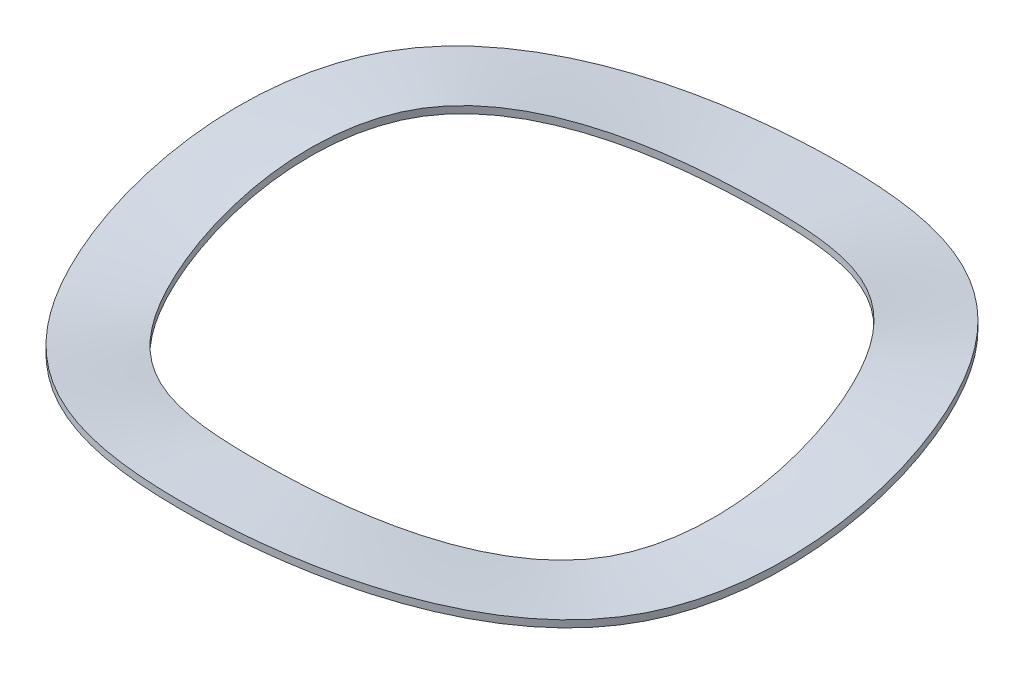
ISO-10303-21;
HEADER;
FILE_DESCRIPTION(('STEP AP214'),'2;1');
FILE_NAME('part.step','',(''),(''),'','','');
FILE_SCHEMA(('AUTOMOTIVE_DESIGN { 1 0 10303 214 1 1 1 1 }'));
ENDSEC;
DATA;
#1=APPLICATION_CONTEXT('core data for automotive mechanical design processes');
#2=APPLICATION_PROTOCOL_DEFINITION('international standard','automotive_design',2000,#1);
#3=PRODUCT_CONTEXT('',#1,'mechanical');
#4=PRODUCT('Part','Part','',(#3));
#5=PRODUCT_RELATED_PRODUCT_CATEGORY('part','',(#4));
#6=PRODUCT_DEFINITION_FORMATION('','',#4);
#7=PRODUCT_DEFINITION_CONTEXT('part definition',#1,'design');
#8=PRODUCT_DEFINITION('design','',#6,#7);
#9=PRODUCT_DEFINITION_SHAPE('','',#8);
#10=(LENGTH_UNIT() NAMED_UNIT(*) SI_UNIT(.MILLI.,.METRE.));
#11=(NAMED_UNIT(*) PLANE_ANGLE_UNIT() SI_UNIT($,.RADIAN.));
#12=(NAMED_UNIT(*) SI_UNIT($,.STERADIAN.) SOLID_ANGLE_UNIT());
#13=UNCERTAINTY_MEASURE_WITH_UNIT(LENGTH_MEASURE(1.E-05),#10,'distance_accuracy_value','');
#14=(GEOMETRIC_REPRESENTATION_CONTEXT(3) GLOBAL_UNCERTAINTY_ASSIGNED_CONTEXT((#13)) GLOBAL_UNIT_ASSIGNED_CONTEXT((#10,
#11,#12)) REPRESENTATION_CONTEXT('',''));
#15=CARTESIAN_POINT('',(0.,0.,0.));
#16=DIRECTION('',(0.,0.,1.));
#17=DIRECTION('',(1.,0.,0.));
#18=AXIS2_PLACEMENT_3D('',#15,#16,#17);
#19=CARTESIAN_POINT('',(-6.21724893790088E-12,0.,-10.6553000000025));
#20=CARTESIAN_POINT('',(3.69110419397156,0.,-10.6553000000078));
#21=CARTESIAN_POINT('',(11.0733125819271,3.12420000000024,-6.39318000000788));
#22=CARTESIAN_POINT('',(11.0733125819298,-1.56210000000012,6.39317999999367));
#23=CARTESIAN_POINT('',(-4.44089209850063E-12,3.1241999999998,12.7863599999971));
#24=CARTESIAN_POINT('',(-11.0733125819387,-1.56209999999835,6.39317999999367));
#25=CARTESIAN_POINT('',(-11.0733125819431,1.5621000000019,-2.13106000000529));
#26=CARTESIAN_POINT('',(-7.38220838795911,1.56210000000012,-8.52424000000607));
#27=CARTESIAN_POINT('',(-3.69110419398311,0.,-10.6553000000025));
#28=CARTESIAN_POINT('',(-6.21724893790088E-12,0.,-10.6553000000025));
#29=CARTESIAN_POINT('',(-3.5527136788005E-12,0.,-11.6755333333414));
#30=CARTESIAN_POINT('',(4.04452338775485,0.,-11.6755333333378));
#31=CARTESIAN_POINT('',(12.1335701632734,3.12420000000024,-7.00532000000731));
#32=CARTESIAN_POINT('',(12.1335701632734,-1.56210000000012,7.00531999999221));
#33=CARTESIAN_POINT('',(-2.66453525910038E-12,3.1241999999998,14.0106399999924));
#34=CARTESIAN_POINT('',(-12.133570163285,-1.56209999999835,7.0053199999931));
#35=CARTESIAN_POINT('',(-12.1335701632841,1.5621000000019,-2.33510666667502));
#36=CARTESIAN_POINT('',(-8.08904677552302,1.5621000000019,-9.34042666667256));
#37=CARTESIAN_POINT('',(-4.04452338776462,0.,-11.6755333333369));
#38=CARTESIAN_POINT('',(-3.5527136788005E-12,0.,-11.6755333333414));
#39=CARTESIAN_POINT('',(-6.21724893790088E-12,0.,-12.6957666666732));
#40=CARTESIAN_POINT('',(4.39794258153814,0.,-12.6957666666705));
#41=CARTESIAN_POINT('',(13.1938277446215,3.12420000000024,-7.61746000000407));
#42=CARTESIAN_POINT('',(13.1938277446162,-1.56210000000012,7.6174599999943));
#43=CARTESIAN_POINT('',(-6.21724893790088E-12,3.1241999999998,15.2349199999948));
#44=CARTESIAN_POINT('',(-13.1938277446286,-1.56209999999835,7.61745999999341));
#45=CARTESIAN_POINT('',(-13.1938277446304,1.5621000000019,-2.53915333333676));
#46=CARTESIAN_POINT('',(-8.79588516308605,1.5621000000019,-10.1566133333408));
#47=CARTESIAN_POINT('',(-4.39794258155057,0.,-12.6957666666723));
#48=CARTESIAN_POINT('',(-6.21724893790088E-12,0.,-12.6957666666732));
#49=CARTESIAN_POINT('',(-9.76996261670138E-12,0.,-13.7160000000041));
#50=CARTESIAN_POINT('',(4.75136177531965,0.,-13.7160000000076));
#51=CARTESIAN_POINT('',(14.2540853259616,3.12420000000024,-8.22960000000705));
#52=CARTESIAN_POINT('',(14.2540853259634,-1.56210000000012,8.22959999999551));
#53=CARTESIAN_POINT('',(-5.32907051820075E-12,3.1241999999998,16.4591999999963));
#54=CARTESIAN_POINT('',(-14.2540853259732,-1.56209999999835,8.22959999999551));
#55=CARTESIAN_POINT('',(-14.2540853259758,1.5621000000019,-2.74320000000738));
#56=CARTESIAN_POINT('',(-9.50272355064907,1.5621000000019,-10.9728000000091));
#57=CARTESIAN_POINT('',(-4.75136177532853,0.,-13.7160000000041));
#58=CARTESIAN_POINT('',(-9.76996261670138E-12,0.,-13.7160000000041));
#59=B_SPLINE_SURFACE_WITH_KNOTS('',3,3,((#19,#20,#21,#22,#23,#24,#25,#26,#27,#28),(#29,#30,#31,
#32,#33,#34,#35,#36,#37,#38),(#39,#40,#41,#42,#43,#44,#45,#46,#47,#48),(#49,#50,#51,#52,#53,#54,
#55,#56,#57,#58)),.UNSPECIFIED.,.F.,.T.,.F.,(4,4),(4,1,1,1,1,2,4),(0.,1.),(0.,0.166666666666667,
0.333333333333334,0.5,0.666666666666666,0.833333333333333,1.),.UNSPECIFIED.);
#60=CARTESIAN_POINT('',(-6.21724893790088E-12,0.,-10.6553000000025));
#61=CARTESIAN_POINT('',(3.69110419397156,0.,-10.6553000000078));
#62=CARTESIAN_POINT('',(11.0733125819271,3.12420000000024,-6.39318000000788));
#63=CARTESIAN_POINT('',(11.0733125819298,-1.56210000000012,6.39317999999367));
#64=CARTESIAN_POINT('',(-4.44089209850063E-12,3.1241999999998,12.7863599999971));
#65=CARTESIAN_POINT('',(-11.0733125819387,-1.56209999999835,6.39317999999367));
#66=CARTESIAN_POINT('',(-11.0733125819431,1.5621000000019,-2.13106000000529));
#67=CARTESIAN_POINT('',(-7.38220838795911,1.56210000000012,-8.52424000000607));
#68=CARTESIAN_POINT('',(-3.69110419398311,0.,-10.6553000000025));
#69=CARTESIAN_POINT('',(-6.21724893790088E-12,0.,-10.6553000000025));
#70=B_SPLINE_CURVE_WITH_KNOTS('',3,(#60,#61,#62,#63,#64,#65,#66,#67,#68,#69),.UNSPECIFIED.,.T.,
.F.,(4,1,1,1,1,2,4),(0.,0.166666666666667,0.333333333333334,0.5,0.666666666666666,
0.833333333333333,1.),.UNSPECIFIED.);
#71=CARTESIAN_POINT('',(-6.21724893790088E-12,0.,-10.6553000000025));
#72=VERTEX_POINT('',#71);
#73=EDGE_CURVE('E31',#72,#72,#70,.T.);
#74=CARTESIAN_POINT('',(-9.76996261670138E-12,0.,-13.7160000000041));
#75=CARTESIAN_POINT('',(4.75136177531965,0.,-13.7160000000076));
#76=CARTESIAN_POINT('',(14.2540853259616,3.12420000000024,-8.22960000000705));
#77=CARTESIAN_POINT('',(14.2540853259634,-1.56210000000012,8.22959999999551));
#78=CARTESIAN_POINT('',(-5.32907051820075E-12,3.1241999999998,16.4591999999963));
#79=CARTESIAN_POINT('',(-14.2540853259732,-1.56209999999835,8.22959999999551));
#80=CARTESIAN_POINT('',(-14.2540853259758,1.5621000000019,-2.74320000000738));
#81=CARTESIAN_POINT('',(-9.50272355064907,1.5621000000019,-10.9728000000091));
#82=CARTESIAN_POINT('',(-4.75136177532853,0.,-13.7160000000041));
#83=CARTESIAN_POINT('',(-9.76996261670138E-12,0.,-13.7160000000041));
#84=B_SPLINE_CURVE_WITH_KNOTS('',3,(#74,#75,#76,#77,#78,#79,#80,#81,#82,#83),.UNSPECIFIED.,.T.,
.F.,(4,1,1,1,1,2,4),(0.,0.166666666666667,0.333333333333334,0.5,0.666666666666666,
0.833333333333333,1.),.UNSPECIFIED.);
#85=CARTESIAN_POINT('',(-9.76996261670138E-12,0.,-13.7160000000041));
#86=VERTEX_POINT('',#85);
#87=EDGE_CURVE('E20',#86,#86,#84,.F.);
#88=ORIENTED_EDGE('',*,*,#73,.F.);
#89=EDGE_LOOP('',(#88));
#90=FACE_BOUND('',#89,.T.);
#91=ORIENTED_EDGE('',*,*,#87,.F.);
#92=EDGE_LOOP('',(#91));
#93=FACE_BOUND('',#92,.T.);
#94=ADVANCED_FACE('F14',(#90,#93),#59,.T.);
#95=CARTESIAN_POINT('',(-9.76996261670138E-12,0.,-13.7160000000041));
#96=CARTESIAN_POINT('',(4.75136177531965,0.,-13.7160000000076));
#97=CARTESIAN_POINT('',(14.2540853259616,3.12420000000024,-8.22960000000705));
#98=CARTESIAN_POINT('',(14.2540853259634,-1.56210000000012,8.22959999999551));
#99=CARTESIAN_POINT('',(-5.32907051820075E-12,3.1241999999998,16.4591999999963));
#100=CARTESIAN_POINT('',(-14.2540853259732,-1.56209999999835,8.22959999999551));
#101=CARTESIAN_POINT('',(-14.2540853259758,1.5621000000019,-2.74320000000738));
#102=CARTESIAN_POINT('',(-9.50272355064907,1.5621000000019,-10.9728000000091));
#103=CARTESIAN_POINT('',(-4.75136177532853,0.,-13.7160000000041));
#104=CARTESIAN_POINT('',(-9.76996261670138E-12,0.,-13.7160000000041));
#105=CARTESIAN_POINT('',(-9.76996261670138E-12,0.0973666666665984,-13.7160000000041));
#106=CARTESIAN_POINT('',(4.75136177531965,0.0973666666665984,-13.7160000000076));
#107=CARTESIAN_POINT('',(14.2540853259616,3.22156666666684,-8.22960000000705));
#108=CARTESIAN_POINT('',(14.2540853259634,-1.46473333333308,8.22959999999551));
#109=CARTESIAN_POINT('',(-5.32907051820075E-12,3.22156666666684,16.4591999999963));
#110=CARTESIAN_POINT('',(-14.2540853259732,-1.46473333333175,8.22959999999551));
#111=CARTESIAN_POINT('',(-14.2540853259758,1.6594666666685,-2.74320000000738));
#112=CARTESIAN_POINT('',(-9.50272355064907,1.6594666666685,-10.9728000000091));
#113=CARTESIAN_POINT('',(-4.75136177532853,0.0973666666665984,-13.7160000000041));
#114=CARTESIAN_POINT('',(-9.76996261670138E-12,0.0973666666665984,-13.7160000000041));
#115=CARTESIAN_POINT('',(-9.76996261670138E-12,0.194733333333197,-13.7160000000041));
#116=CARTESIAN_POINT('',(4.75136177531965,0.194733333333197,-13.7160000000076));
#117=CARTESIAN_POINT('',(14.2540853259616,3.31893333333344,-8.22960000000705));
#118=CARTESIAN_POINT('',(14.2540853259634,-1.36736666666648,8.22959999999551));
#119=CARTESIAN_POINT('',(-5.32907051820075E-12,3.31893333333344,16.4591999999963));
#120=CARTESIAN_POINT('',(-14.2540853259732,-1.3673666666647,8.22959999999551));
#121=CARTESIAN_POINT('',(-14.2540853259758,1.75683333333509,-2.74320000000738));
#122=CARTESIAN_POINT('',(-9.50272355064907,1.75683333333509,-10.9728000000091));
#123=CARTESIAN_POINT('',(-4.75136177532853,0.194733333333197,-13.7160000000041));
#124=CARTESIAN_POINT('',(-9.76996261670138E-12,0.194733333333197,-13.7160000000041));
#125=CARTESIAN_POINT('',(-9.76996261670138E-12,0.292099999999795,-13.7160000000041));
#126=CARTESIAN_POINT('',(4.75136177531965,0.292099999999795,-13.7160000000076));
#127=CARTESIAN_POINT('',(14.2540853259616,3.41630000000004,-8.22960000000705));
#128=CARTESIAN_POINT('',(14.2540853259634,-1.26999999999988,8.22959999999551));
#129=CARTESIAN_POINT('',(-5.32907051820075E-12,3.41630000000004,16.4591999999963));
#130=CARTESIAN_POINT('',(-14.2540853259732,-1.26999999999811,8.22959999999551));
#131=CARTESIAN_POINT('',(-14.2540853259758,1.85420000000169,-2.74320000000738));
#132=CARTESIAN_POINT('',(-9.50272355064907,1.85420000000169,-10.9728000000091));
#133=CARTESIAN_POINT('',(-4.75136177532853,0.292099999999795,-13.7160000000041));
#134=CARTESIAN_POINT('',(-9.76996261670138E-12,0.292099999999795,-13.7160000000041));
#135=B_SPLINE_SURFACE_WITH_KNOTS('',3,3,((#95,#96,#97,#98,#99,#100,#101,#102,#103,#104),(#105,
#106,#107,#108,#109,#110,#111,#112,#113,#114),(#115,#116,#117,#118,#119,#120,#121,#122,#123,
#124),(#125,#126,#127,#128,#129,#130,#131,#132,#133,#134)),.UNSPECIFIED.,.F.,.T.,.F.,(4,4),(4,1,
1,1,1,2,4),(0.,1.),(0.,0.166666666666667,0.333333333333334,0.5,0.666666666666666,
0.833333333333333,1.),.UNSPECIFIED.);
#136=CARTESIAN_POINT('',(-9.76996261670138E-12,0.292099999999795,-13.7160000000041));
#137=CARTESIAN_POINT('',(4.75136177531965,0.292099999999795,-13.7160000000076));
#138=CARTESIAN_POINT('',(14.2540853259616,3.41630000000004,-8.22960000000705));
#139=CARTESIAN_POINT('',(14.2540853259634,-1.26999999999988,8.22959999999551));
#140=CARTESIAN_POINT('',(-5.32907051820075E-12,3.41630000000004,16.4591999999963));
#141=CARTESIAN_POINT('',(-14.2540853259732,-1.26999999999811,8.22959999999551));
#142=CARTESIAN_POINT('',(-14.2540853259758,1.85420000000169,-2.74320000000738));
#143=CARTESIAN_POINT('',(-9.50272355064907,1.85420000000169,-10.9728000000091));
#144=CARTESIAN_POINT('',(-4.75136177532853,0.292099999999795,-13.7160000000041));
#145=CARTESIAN_POINT('',(-9.76996261670138E-12,0.292099999999795,-13.7160000000041));
#146=B_SPLINE_CURVE_WITH_KNOTS('',3,(#136,#137,#138,#139,#140,#141,#142,#143,#144,#145),
.UNSPECIFIED.,.T.,.F.,(4,1,1,1,1,2,4),(0.,0.166666666666667,0.333333333333334,0.5,
0.666666666666666,0.833333333333333,1.),.UNSPECIFIED.);
#147=CARTESIAN_POINT('',(-9.76996261670138E-12,0.292099999999795,-13.7160000000041));
#148=VERTEX_POINT('',#147);
#149=EDGE_CURVE('E26',#148,#148,#146,.F.);
#150=ORIENTED_EDGE('',*,*,#87,.T.);
#151=EDGE_LOOP('',(#150));
#152=FACE_BOUND('',#151,.T.);
#153=ORIENTED_EDGE('',*,*,#149,.F.);
#154=EDGE_LOOP('',(#153));
#155=FACE_BOUND('',#154,.T.);
#156=ADVANCED_FACE('F54',(#152,#155),#135,.T.);
#157=CARTESIAN_POINT('',(-6.21724893790088E-12,0.292099999999795,-10.6553000000025));
#158=CARTESIAN_POINT('',(3.69110419397156,0.292099999999795,-10.6553000000078));
#159=CARTESIAN_POINT('',(11.0733125819271,3.41630000000004,-6.39318000000788));
#160=CARTESIAN_POINT('',(11.0733125819298,-1.26999999999988,6.39317999999367));
#161=CARTESIAN_POINT('',(-4.44089209850063E-12,3.41630000000004,12.7863599999971));
#162=CARTESIAN_POINT('',(-11.0733125819387,-1.26999999999811,6.39317999999367));
#163=CARTESIAN_POINT('',(-11.0733125819431,1.85420000000169,-2.13106000000529));
#164=CARTESIAN_POINT('',(-7.38220838795911,1.85419999999992,-8.52424000000607));
#165=CARTESIAN_POINT('',(-3.69110419398311,0.292099999999795,-10.6553000000025));
#166=CARTESIAN_POINT('',(-6.21724893790088E-12,0.292099999999795,-10.6553000000025));
#167=CARTESIAN_POINT('',(-6.21724893790088E-12,0.194733333333197,-10.6553000000025));
#168=CARTESIAN_POINT('',(3.69110419397156,0.194733333333197,-10.6553000000078));
#169=CARTESIAN_POINT('',(11.0733125819271,3.31893333333344,-6.39318000000788));
#170=CARTESIAN_POINT('',(11.0733125819298,-1.36736666666648,6.39317999999367));
#171=CARTESIAN_POINT('',(-4.44089209850063E-12,3.31893333333344,12.7863599999971));
#172=CARTESIAN_POINT('',(-11.0733125819387,-1.3673666666647,6.39317999999367));
#173=CARTESIAN_POINT('',(-11.0733125819431,1.75683333333509,-2.13106000000529));
#174=CARTESIAN_POINT('',(-7.38220838795911,1.75683333333332,-8.52424000000607));
#175=CARTESIAN_POINT('',(-3.69110419398311,0.194733333333197,-10.6553000000025));
#176=CARTESIAN_POINT('',(-6.21724893790088E-12,0.194733333333197,-10.6553000000025));
#177=CARTESIAN_POINT('',(-6.21724893790088E-12,0.0973666666665984,-10.6553000000025));
#178=CARTESIAN_POINT('',(3.69110419397156,0.0973666666665984,-10.6553000000078));
#179=CARTESIAN_POINT('',(11.0733125819271,3.22156666666684,-6.39318000000788));
#180=CARTESIAN_POINT('',(11.0733125819298,-1.46473333333308,6.39317999999367));
#181=CARTESIAN_POINT('',(-4.44089209850063E-12,3.22156666666684,12.7863599999971));
#182=CARTESIAN_POINT('',(-11.0733125819387,-1.46473333333175,6.39317999999367));
#183=CARTESIAN_POINT('',(-11.0733125819431,1.6594666666685,-2.13106000000529));
#184=CARTESIAN_POINT('',(-7.38220838795911,1.65946666666672,-8.52424000000607));
#185=CARTESIAN_POINT('',(-3.69110419398311,0.0973666666665984,-10.6553000000025));
#186=CARTESIAN_POINT('',(-6.21724893790088E-12,0.0973666666665984,-10.6553000000025));
#187=CARTESIAN_POINT('',(-6.21724893790088E-12,0.,-10.6553000000025));
#188=CARTESIAN_POINT('',(3.69110419397156,0.,-10.6553000000078));
#189=CARTESIAN_POINT('',(11.0733125819271,3.12420000000024,-6.39318000000788));
#190=CARTESIAN_POINT('',(11.0733125819298,-1.56210000000012,6.39317999999367));
#191=CARTESIAN_POINT('',(-4.44089209850063E-12,3.1241999999998,12.7863599999971));
#192=CARTESIAN_POINT('',(-11.0733125819387,-1.56209999999835,6.39317999999367));
#193=CARTESIAN_POINT('',(-11.0733125819431,1.5621000000019,-2.13106000000529));
#194=CARTESIAN_POINT('',(-7.38220838795911,1.56210000000012,-8.52424000000607));
#195=CARTESIAN_POINT('',(-3.69110419398311,0.,-10.6553000000025));
#196=CARTESIAN_POINT('',(-6.21724893790088E-12,0.,-10.6553000000025));
#197=B_SPLINE_SURFACE_WITH_KNOTS('',3,3,((#157,#158,#159,#160,#161,#162,#163,#164,#165,#166),
(#167,#168,#169,#170,#171,#172,#173,#174,#175,#176),(#177,#178,#179,#180,#181,#182,#183,#184,
#185,#186),(#187,#188,#189,#190,#191,#192,#193,#194,#195,#196)),.UNSPECIFIED.,.F.,.T.,.F.,(4,4),
(4,1,1,1,1,2,4),(0.,1.),(0.,0.166666666666667,0.333333333333334,0.5,0.666666666666666,
0.833333333333333,1.),.UNSPECIFIED.);
#198=CARTESIAN_POINT('',(-6.21724893790088E-12,0.292099999999795,-10.6553000000025));
#199=CARTESIAN_POINT('',(3.69110419397156,0.292099999999795,-10.6553000000078));
#200=CARTESIAN_POINT('',(11.0733125819271,3.41630000000004,-6.39318000000788));
#201=CARTESIAN_POINT('',(11.0733125819298,-1.26999999999988,6.39317999999367));
#202=CARTESIAN_POINT('',(-4.44089209850063E-12,3.41630000000004,12.7863599999971));
#203=CARTESIAN_POINT('',(-11.0733125819387,-1.26999999999811,6.39317999999367));
#204=CARTESIAN_POINT('',(-11.0733125819431,1.85420000000169,-2.13106000000529));
#205=CARTESIAN_POINT('',(-7.38220838795911,1.85419999999992,-8.52424000000607));
#206=CARTESIAN_POINT('',(-3.69110419398311,0.292099999999795,-10.6553000000025));
#207=CARTESIAN_POINT('',(-6.21724893790088E-12,0.292099999999795,-10.6553000000025));
#208=B_SPLINE_CURVE_WITH_KNOTS('',3,(#198,#199,#200,#201,#202,#203,#204,#205,#206,#207),
.UNSPECIFIED.,.T.,.F.,(4,1,1,1,1,2,4),(0.,0.166666666666667,0.333333333333334,0.5,
0.666666666666666,0.833333333333333,1.),.UNSPECIFIED.);
#209=CARTESIAN_POINT('',(-6.21724893790088E-12,0.292099999999795,-10.6553000000025));
#210=VERTEX_POINT('',#209);
#211=EDGE_CURVE('E10',#210,#210,#208,.T.);
#212=ORIENTED_EDGE('',*,*,#73,.T.);
#213=EDGE_LOOP('',(#212));
#214=FACE_BOUND('',#213,.T.);
#215=ORIENTED_EDGE('',*,*,#211,.F.);
#216=EDGE_LOOP('',(#215));
#217=FACE_BOUND('',#216,.T.);
#218=ADVANCED_FACE('F64',(#214,#217),#197,.T.);
#219=CARTESIAN_POINT('',(-9.76996261670138E-12,0.292099999999795,-13.7160000000041));
#220=CARTESIAN_POINT('',(4.75136177531965,0.292099999999795,-13.7160000000076));
#221=CARTESIAN_POINT('',(14.2540853259616,3.41630000000004,-8.22960000000705));
#222=CARTESIAN_POINT('',(14.2540853259634,-1.26999999999988,8.22959999999551));
#223=CARTESIAN_POINT('',(-5.32907051820075E-12,3.41630000000004,16.4591999999963));
#224=CARTESIAN_POINT('',(-14.2540853259732,-1.26999999999811,8.22959999999551));
#225=CARTESIAN_POINT('',(-14.2540853259758,1.85420000000169,-2.74320000000738));
#226=CARTESIAN_POINT('',(-9.50272355064907,1.85420000000169,-10.9728000000091));
#227=CARTESIAN_POINT('',(-4.75136177532853,0.292099999999795,-13.7160000000041));
#228=CARTESIAN_POINT('',(-9.76996261670138E-12,0.292099999999795,-13.7160000000041));
#229=CARTESIAN_POINT('',(-6.21724893790088E-12,0.292099999999795,-12.6957666666732));
#230=CARTESIAN_POINT('',(4.39794258153814,0.292099999999795,-12.6957666666705));
#231=CARTESIAN_POINT('',(13.1938277446215,3.41630000000004,-7.61746000000407));
#232=CARTESIAN_POINT('',(13.1938277446162,-1.26999999999988,7.6174599999943));
#233=CARTESIAN_POINT('',(-6.21724893790088E-12,3.41630000000004,15.2349199999948));
#234=CARTESIAN_POINT('',(-13.1938277446286,-1.26999999999811,7.61745999999341));
#235=CARTESIAN_POINT('',(-13.1938277446304,1.85420000000169,-2.53915333333676));
#236=CARTESIAN_POINT('',(-8.79588516308605,1.85420000000169,-10.1566133333408));
#237=CARTESIAN_POINT('',(-4.39794258155057,0.292099999999795,-12.6957666666723));
#238=CARTESIAN_POINT('',(-6.21724893790088E-12,0.292099999999795,-12.6957666666732));
#239=CARTESIAN_POINT('',(-3.5527136788005E-12,0.292099999999795,-11.6755333333414));
#240=CARTESIAN_POINT('',(4.04452338775485,0.292099999999795,-11.6755333333378));
#241=CARTESIAN_POINT('',(12.1335701632734,3.41630000000004,-7.00532000000731));
#242=CARTESIAN_POINT('',(12.1335701632734,-1.26999999999988,7.00531999999221));
#243=CARTESIAN_POINT('',(-2.66453525910038E-12,3.41630000000004,14.0106399999924));
#244=CARTESIAN_POINT('',(-12.133570163285,-1.26999999999811,7.0053199999931));
#245=CARTESIAN_POINT('',(-12.1335701632841,1.85420000000169,-2.33510666667502));
#246=CARTESIAN_POINT('',(-8.08904677552302,1.85420000000169,-9.34042666667256));
#247=CARTESIAN_POINT('',(-4.04452338776462,0.292099999999795,-11.6755333333369));
#248=CARTESIAN_POINT('',(-3.5527136788005E-12,0.292099999999795,-11.6755333333414));
#249=CARTESIAN_POINT('',(-6.21724893790088E-12,0.292099999999795,-10.6553000000025));
#250=CARTESIAN_POINT('',(3.69110419397156,0.292099999999795,-10.6553000000078));
#251=CARTESIAN_POINT('',(11.0733125819271,3.41630000000004,-6.39318000000788));
#252=CARTESIAN_POINT('',(11.0733125819298,-1.26999999999988,6.39317999999367));
#253=CARTESIAN_POINT('',(-4.44089209850063E-12,3.41630000000004,12.7863599999971));
#254=CARTESIAN_POINT('',(-11.0733125819387,-1.26999999999811,6.39317999999367));
#255=CARTESIAN_POINT('',(-11.0733125819431,1.85420000000169,-2.13106000000529));
#256=CARTESIAN_POINT('',(-7.38220838795911,1.85419999999992,-8.52424000000607));
#257=CARTESIAN_POINT('',(-3.69110419398311,0.292099999999795,-10.6553000000025));
#258=CARTESIAN_POINT('',(-6.21724893790088E-12,0.292099999999795,-10.6553000000025));
#259=B_SPLINE_SURFACE_WITH_KNOTS('',3,3,((#219,#220,#221,#222,#223,#224,#225,#226,#227,#228),
(#229,#230,#231,#232,#233,#234,#235,#236,#237,#238),(#239,#240,#241,#242,#243,#244,#245,#246,
#247,#248),(#249,#250,#251,#252,#253,#254,#255,#256,#257,#258)),.UNSPECIFIED.,.F.,.T.,.F.,(4,4),
(4,1,1,1,1,2,4),(0.,1.),(0.,0.166666666666667,0.333333333333334,0.5,0.666666666666666,
0.833333333333333,1.),.UNSPECIFIED.);
#260=ORIENTED_EDGE('',*,*,#149,.T.);
#261=EDGE_LOOP('',(#260));
#262=FACE_BOUND('',#261,.T.);
#263=ORIENTED_EDGE('',*,*,#211,.T.);
#264=EDGE_LOOP('',(#263));
#265=FACE_BOUND('',#264,.T.);
#266=ADVANCED_FACE('F16',(#262,#265),#259,.T.);
#267=CLOSED_SHELL('',(#94,#156,#218,#266));
#268=MANIFOLD_SOLID_BREP('B1',#267);
#269=ADVANCED_BREP_SHAPE_REPRESENTATION('',(#18,#268),#14);
#270=SHAPE_DEFINITION_REPRESENTATION(#9,#269);
ENDSEC;
END-ISO-10303-21;
